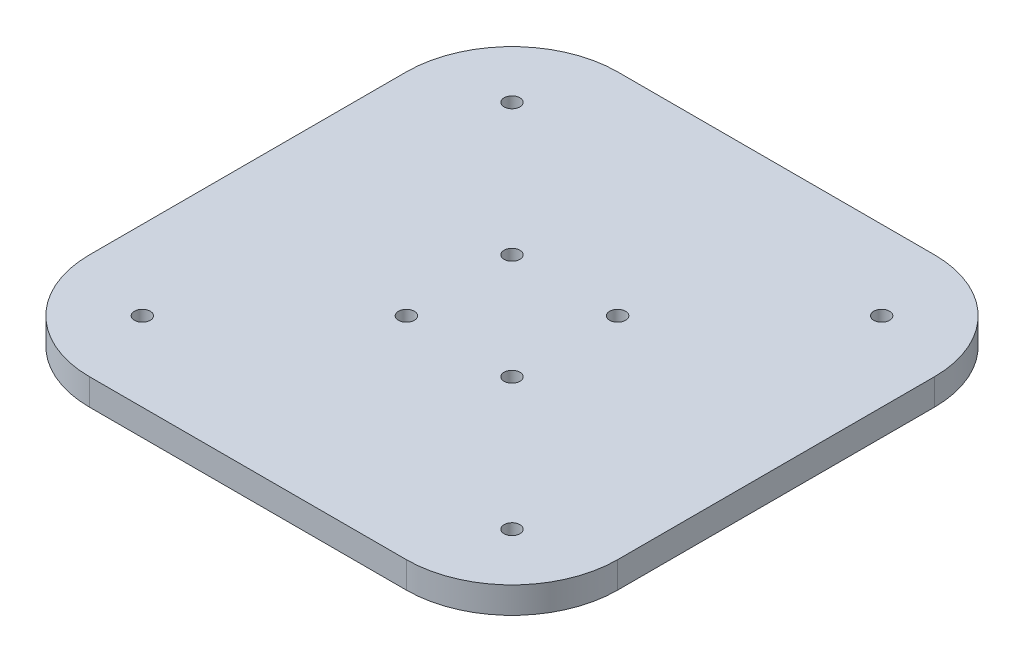
ISO-10303-21;
HEADER;
FILE_DESCRIPTION(('STEP AP214'),'2;1');
FILE_NAME('part.step','',(''),(''),'','','');
FILE_SCHEMA(('AUTOMOTIVE_DESIGN { 1 0 10303 214 1 1 1 1 }'));
ENDSEC;
DATA;
#1=APPLICATION_CONTEXT('core data for automotive mechanical design processes');
#2=APPLICATION_PROTOCOL_DEFINITION('international standard','automotive_design',2000,#1);
#3=PRODUCT_CONTEXT('',#1,'mechanical');
#4=PRODUCT('Part','Part','',(#3));
#5=PRODUCT_RELATED_PRODUCT_CATEGORY('part','',(#4));
#6=PRODUCT_DEFINITION_FORMATION('','',#4);
#7=PRODUCT_DEFINITION_CONTEXT('part definition',#1,'design');
#8=PRODUCT_DEFINITION('design','',#6,#7);
#9=PRODUCT_DEFINITION_SHAPE('','',#8);
#10=(LENGTH_UNIT() NAMED_UNIT(*) SI_UNIT(.MILLI.,.METRE.));
#11=(NAMED_UNIT(*) PLANE_ANGLE_UNIT() SI_UNIT($,.RADIAN.));
#12=(NAMED_UNIT(*) SI_UNIT($,.STERADIAN.) SOLID_ANGLE_UNIT());
#13=UNCERTAINTY_MEASURE_WITH_UNIT(LENGTH_MEASURE(1.E-05),#10,'distance_accuracy_value','');
#14=(GEOMETRIC_REPRESENTATION_CONTEXT(3) GLOBAL_UNCERTAINTY_ASSIGNED_CONTEXT((#13)) GLOBAL_UNIT_ASSIGNED_CONTEXT((#10,
#11,#12)) REPRESENTATION_CONTEXT('',''));
#15=CARTESIAN_POINT('',(0.,0.,0.));
#16=DIRECTION('',(0.,0.,1.));
#17=DIRECTION('',(1.,0.,0.));
#18=AXIS2_PLACEMENT_3D('',#15,#16,#17);
#19=CARTESIAN_POINT('',(0.,5.,0.));
#20=DIRECTION('',(0.,1.,0.));
#21=DIRECTION('',(0.,0.,1.));
#22=AXIS2_PLACEMENT_3D('',#19,#20,#21);
#23=PLANE('',#22);
#24=CARTESIAN_POINT('',(35.000000000005,5.,34.9999999999964));
#25=DIRECTION('',(0.,1.,0.));
#26=DIRECTION('',(0.,0.,1.));
#27=AXIS2_PLACEMENT_3D('',#24,#25,#26);
#28=CIRCLE('',#27,1.50000000000613);
#29=CARTESIAN_POINT('',(35.000000000005,5.,36.5000000000025));
#30=VERTEX_POINT('',#29);
#31=EDGE_CURVE('E216',#30,#30,#28,.T.);
#32=ORIENTED_EDGE('',*,*,#31,.F.);
#33=EDGE_LOOP('',(#32));
#34=FACE_BOUND('',#33,.T.);
#35=CARTESIAN_POINT('',(-10.,5.,10.));
#36=DIRECTION('',(0.,1.,0.));
#37=DIRECTION('',(0.,0.,-1.));
#38=AXIS2_PLACEMENT_3D('',#35,#36,#37);
#39=CIRCLE('',#38,1.5);
#40=CARTESIAN_POINT('',(-10.,5.,8.5));
#41=VERTEX_POINT('',#40);
#42=EDGE_CURVE('E204',#41,#41,#39,.T.);
#43=ORIENTED_EDGE('',*,*,#42,.F.);
#44=EDGE_LOOP('',(#43));
#45=FACE_BOUND('',#44,.T.);
#46=CARTESIAN_POINT('',(10.,5.,-10.));
#47=DIRECTION('',(0.,1.,0.));
#48=DIRECTION('',(0.,0.,-1.));
#49=AXIS2_PLACEMENT_3D('',#46,#47,#48);
#50=CIRCLE('',#49,1.5);
#51=CARTESIAN_POINT('',(10.,5.,-11.5));
#52=VERTEX_POINT('',#51);
#53=EDGE_CURVE('E192',#52,#52,#50,.T.);
#54=ORIENTED_EDGE('',*,*,#53,.F.);
#55=EDGE_LOOP('',(#54));
#56=FACE_BOUND('',#55,.T.);
#57=CARTESIAN_POINT('',(-35.,5.,-35.));
#58=DIRECTION('',(0.,1.,0.));
#59=DIRECTION('',(0.,0.,1.));
#60=AXIS2_PLACEMENT_3D('',#57,#58,#59);
#61=CIRCLE('',#60,1.5);
#62=CARTESIAN_POINT('',(-35.,5.,-33.5));
#63=VERTEX_POINT('',#62);
#64=EDGE_CURVE('E138',#63,#63,#61,.T.);
#65=ORIENTED_EDGE('',*,*,#64,.F.);
#66=EDGE_LOOP('',(#65));
#67=FACE_BOUND('',#66,.T.);
#68=DIRECTION('',(0.,0.,1.));
#69=VECTOR('',#68,1.);
#70=CARTESIAN_POINT('',(-50.,5.,50.));
#71=LINE('',#70,#69);
#72=CARTESIAN_POINT('',(-50.,5.,-30.));
#73=VERTEX_POINT('',#72);
#74=CARTESIAN_POINT('',(-50.,5.,30.));
#75=VERTEX_POINT('',#74);
#76=EDGE_CURVE('E143',#73,#75,#71,.T.);
#77=ORIENTED_EDGE('',*,*,#76,.T.);
#78=CARTESIAN_POINT('',(-30.,5.,30.));
#79=DIRECTION('',(0.,1.,0.));
#80=DIRECTION('',(0.,0.,1.));
#81=AXIS2_PLACEMENT_3D('',#78,#79,#80);
#82=CIRCLE('',#81,20.);
#83=CARTESIAN_POINT('',(-30.,5.,50.));
#84=VERTEX_POINT('',#83);
#85=EDGE_CURVE('E158',#75,#84,#82,.T.);
#86=ORIENTED_EDGE('',*,*,#85,.T.);
#87=DIRECTION('',(1.,0.,0.));
#88=VECTOR('',#87,1.);
#89=CARTESIAN_POINT('',(50.,5.,50.));
#90=LINE('',#89,#88);
#91=CARTESIAN_POINT('',(30.,5.,50.));
#92=VERTEX_POINT('',#91);
#93=EDGE_CURVE('E125',#84,#92,#90,.T.);
#94=ORIENTED_EDGE('',*,*,#93,.T.);
#95=CARTESIAN_POINT('',(30.,5.,30.));
#96=DIRECTION('',(0.,1.,0.));
#97=DIRECTION('',(0.,0.,1.));
#98=AXIS2_PLACEMENT_3D('',#95,#96,#97);
#99=CIRCLE('',#98,20.);
#100=CARTESIAN_POINT('',(50.,5.,30.));
#101=VERTEX_POINT('',#100);
#102=EDGE_CURVE('E156',#92,#101,#99,.T.);
#103=ORIENTED_EDGE('',*,*,#102,.T.);
#104=DIRECTION('',(0.,0.,-1.));
#105=VECTOR('',#104,1.);
#106=CARTESIAN_POINT('',(50.,5.,50.));
#107=LINE('',#106,#105);
#108=CARTESIAN_POINT('',(50.,5.,-30.));
#109=VERTEX_POINT('',#108);
#110=EDGE_CURVE('E169',#101,#109,#107,.T.);
#111=ORIENTED_EDGE('',*,*,#110,.T.);
#112=CARTESIAN_POINT('',(30.,5.,-30.));
#113=DIRECTION('',(0.,1.,0.));
#114=DIRECTION('',(0.,0.,1.));
#115=AXIS2_PLACEMENT_3D('',#112,#113,#114);
#116=CIRCLE('',#115,20.);
#117=CARTESIAN_POINT('',(30.,5.,-50.));
#118=VERTEX_POINT('',#117);
#119=EDGE_CURVE('E60',#109,#118,#116,.T.);
#120=ORIENTED_EDGE('',*,*,#119,.T.);
#121=DIRECTION('',(-1.,0.,0.));
#122=VECTOR('',#121,1.);
#123=CARTESIAN_POINT('',(50.,5.,-50.));
#124=LINE('',#123,#122);
#125=CARTESIAN_POINT('',(-30.,5.,-50.));
#126=VERTEX_POINT('',#125);
#127=EDGE_CURVE('E144',#118,#126,#124,.T.);
#128=ORIENTED_EDGE('',*,*,#127,.T.);
#129=CARTESIAN_POINT('',(-30.,5.,-30.));
#130=DIRECTION('',(0.,1.,0.));
#131=DIRECTION('',(0.,0.,1.));
#132=AXIS2_PLACEMENT_3D('',#129,#130,#131);
#133=CIRCLE('',#132,20.);
#134=EDGE_CURVE('E153',#126,#73,#133,.T.);
#135=ORIENTED_EDGE('',*,*,#134,.T.);
#136=EDGE_LOOP('',(#77,#86,#94,#103,#111,#120,#128,#135));
#137=FACE_BOUND('',#136,.T.);
#138=CARTESIAN_POINT('',(-10.,5.,-10.));
#139=DIRECTION('',(0.,1.,0.));
#140=DIRECTION('',(0.,0.,1.));
#141=AXIS2_PLACEMENT_3D('',#138,#139,#140);
#142=CIRCLE('',#141,1.5);
#143=CARTESIAN_POINT('',(-10.,5.,-8.5));
#144=VERTEX_POINT('',#143);
#145=EDGE_CURVE('E186',#144,#144,#142,.T.);
#146=ORIENTED_EDGE('',*,*,#145,.F.);
#147=EDGE_LOOP('',(#146));
#148=FACE_BOUND('',#147,.T.);
#149=CARTESIAN_POINT('',(10.,5.,10.));
#150=DIRECTION('',(0.,1.,0.));
#151=DIRECTION('',(0.,0.,1.));
#152=AXIS2_PLACEMENT_3D('',#149,#150,#151);
#153=CIRCLE('',#152,1.5);
#154=CARTESIAN_POINT('',(10.,5.,11.5));
#155=VERTEX_POINT('',#154);
#156=EDGE_CURVE('E198',#155,#155,#153,.T.);
#157=ORIENTED_EDGE('',*,*,#156,.F.);
#158=EDGE_LOOP('',(#157));
#159=FACE_BOUND('',#158,.T.);
#160=CARTESIAN_POINT('',(35.0000000000007,5.,-35.0000000000043));
#161=DIRECTION('',(0.,1.,0.));
#162=DIRECTION('',(0.,0.,1.));
#163=AXIS2_PLACEMENT_3D('',#160,#161,#162);
#164=CIRCLE('',#163,1.50000000000408);
#165=CARTESIAN_POINT('',(35.0000000000007,5.,-33.5000000000002));
#166=VERTEX_POINT('',#165);
#167=EDGE_CURVE('E210',#166,#166,#164,.T.);
#168=ORIENTED_EDGE('',*,*,#167,.F.);
#169=EDGE_LOOP('',(#168));
#170=FACE_BOUND('',#169,.T.);
#171=CARTESIAN_POINT('',(-34.9999999999957,5.,35.0000000000007));
#172=DIRECTION('',(0.,1.,0.));
#173=DIRECTION('',(0.,0.,1.));
#174=AXIS2_PLACEMENT_3D('',#171,#172,#173);
#175=CIRCLE('',#174,1.50000000000235);
#176=CARTESIAN_POINT('',(-34.9999999999957,5.,36.500000000003));
#177=VERTEX_POINT('',#176);
#178=EDGE_CURVE('E222',#177,#177,#175,.T.);
#179=ORIENTED_EDGE('',*,*,#178,.F.);
#180=EDGE_LOOP('',(#179));
#181=FACE_BOUND('',#180,.T.);
#182=ADVANCED_FACE('F39',(#34,#45,#56,#67,#137,#148,#159,#170,#181),#23,.T.);
#183=CARTESIAN_POINT('',(0.,0.,0.));
#184=DIRECTION('',(0.,1.,0.));
#185=DIRECTION('',(0.,0.,1.));
#186=AXIS2_PLACEMENT_3D('',#183,#184,#185);
#187=PLANE('',#186);
#188=DIRECTION('',(1.,0.,0.));
#189=VECTOR('',#188,1.);
#190=CARTESIAN_POINT('',(50.,0.,50.));
#191=LINE('',#190,#189);
#192=CARTESIAN_POINT('',(-30.,0.,50.));
#193=VERTEX_POINT('',#192);
#194=CARTESIAN_POINT('',(30.,0.,50.));
#195=VERTEX_POINT('',#194);
#196=EDGE_CURVE('E122',#193,#195,#191,.T.);
#197=ORIENTED_EDGE('',*,*,#196,.F.);
#198=CARTESIAN_POINT('',(-30.,0.,30.));
#199=DIRECTION('',(0.,1.,0.));
#200=DIRECTION('',(0.,0.,1.));
#201=AXIS2_PLACEMENT_3D('',#198,#199,#200);
#202=CIRCLE('',#201,20.);
#203=CARTESIAN_POINT('',(-50.,0.,30.));
#204=VERTEX_POINT('',#203);
#205=EDGE_CURVE('E105',#193,#204,#202,.F.);
#206=ORIENTED_EDGE('',*,*,#205,.T.);
#207=DIRECTION('',(0.,0.,1.));
#208=VECTOR('',#207,1.);
#209=CARTESIAN_POINT('',(-50.,0.,50.));
#210=LINE('',#209,#208);
#211=CARTESIAN_POINT('',(-50.,0.,-30.));
#212=VERTEX_POINT('',#211);
#213=EDGE_CURVE('E133',#212,#204,#210,.T.);
#214=ORIENTED_EDGE('',*,*,#213,.F.);
#215=CARTESIAN_POINT('',(-30.,0.,-30.));
#216=DIRECTION('',(0.,1.,0.));
#217=DIRECTION('',(0.,0.,1.));
#218=AXIS2_PLACEMENT_3D('',#215,#216,#217);
#219=CIRCLE('',#218,20.);
#220=CARTESIAN_POINT('',(-30.,0.,-50.));
#221=VERTEX_POINT('',#220);
#222=EDGE_CURVE('E126',#212,#221,#219,.F.);
#223=ORIENTED_EDGE('',*,*,#222,.T.);
#224=DIRECTION('',(-1.,0.,0.));
#225=VECTOR('',#224,1.);
#226=CARTESIAN_POINT('',(50.,0.,-50.));
#227=LINE('',#226,#225);
#228=CARTESIAN_POINT('',(30.,0.,-50.));
#229=VERTEX_POINT('',#228);
#230=EDGE_CURVE('E136',#229,#221,#227,.T.);
#231=ORIENTED_EDGE('',*,*,#230,.F.);
#232=CARTESIAN_POINT('',(30.,0.,-30.));
#233=DIRECTION('',(0.,1.,0.));
#234=DIRECTION('',(0.,0.,1.));
#235=AXIS2_PLACEMENT_3D('',#232,#233,#234);
#236=CIRCLE('',#235,20.);
#237=CARTESIAN_POINT('',(50.,0.,-30.));
#238=VERTEX_POINT('',#237);
#239=EDGE_CURVE('E147',#229,#238,#236,.F.);
#240=ORIENTED_EDGE('',*,*,#239,.T.);
#241=DIRECTION('',(0.,0.,-1.));
#242=VECTOR('',#241,1.);
#243=CARTESIAN_POINT('',(50.,0.,50.));
#244=LINE('',#243,#242);
#245=CARTESIAN_POINT('',(50.,0.,30.));
#246=VERTEX_POINT('',#245);
#247=EDGE_CURVE('E132',#246,#238,#244,.T.);
#248=ORIENTED_EDGE('',*,*,#247,.F.);
#249=CARTESIAN_POINT('',(30.,0.,30.));
#250=DIRECTION('',(0.,1.,0.));
#251=DIRECTION('',(0.,0.,1.));
#252=AXIS2_PLACEMENT_3D('',#249,#250,#251);
#253=CIRCLE('',#252,20.);
#254=EDGE_CURVE('E116',#246,#195,#253,.F.);
#255=ORIENTED_EDGE('',*,*,#254,.T.);
#256=EDGE_LOOP('',(#197,#206,#214,#223,#231,#240,#248,#255));
#257=FACE_BOUND('',#256,.T.);
#258=CARTESIAN_POINT('',(-35.,0.,-35.));
#259=DIRECTION('',(0.,1.,0.));
#260=DIRECTION('',(0.,0.,1.));
#261=AXIS2_PLACEMENT_3D('',#258,#259,#260);
#262=CIRCLE('',#261,1.5);
#263=CARTESIAN_POINT('',(-35.,0.,-33.5));
#264=VERTEX_POINT('',#263);
#265=EDGE_CURVE('E183',#264,#264,#262,.T.);
#266=ORIENTED_EDGE('',*,*,#265,.T.);
#267=EDGE_LOOP('',(#266));
#268=FACE_BOUND('',#267,.T.);
#269=CARTESIAN_POINT('',(-10.,0.,-10.));
#270=DIRECTION('',(0.,1.,0.));
#271=DIRECTION('',(0.,0.,1.));
#272=AXIS2_PLACEMENT_3D('',#269,#270,#271);
#273=CIRCLE('',#272,1.5);
#274=CARTESIAN_POINT('',(-10.,0.,-8.5));
#275=VERTEX_POINT('',#274);
#276=EDGE_CURVE('E189',#275,#275,#273,.T.);
#277=ORIENTED_EDGE('',*,*,#276,.T.);
#278=EDGE_LOOP('',(#277));
#279=FACE_BOUND('',#278,.T.);
#280=CARTESIAN_POINT('',(10.,0.,-10.));
#281=DIRECTION('',(0.,1.,0.));
#282=DIRECTION('',(0.,0.,-1.));
#283=AXIS2_PLACEMENT_3D('',#280,#281,#282);
#284=CIRCLE('',#283,1.5);
#285=CARTESIAN_POINT('',(10.,0.,-11.5));
#286=VERTEX_POINT('',#285);
#287=EDGE_CURVE('E195',#286,#286,#284,.T.);
#288=ORIENTED_EDGE('',*,*,#287,.T.);
#289=EDGE_LOOP('',(#288));
#290=FACE_BOUND('',#289,.T.);
#291=CARTESIAN_POINT('',(10.,0.,10.));
#292=DIRECTION('',(0.,1.,0.));
#293=DIRECTION('',(0.,0.,1.));
#294=AXIS2_PLACEMENT_3D('',#291,#292,#293);
#295=CIRCLE('',#294,1.5);
#296=CARTESIAN_POINT('',(10.,0.,11.5));
#297=VERTEX_POINT('',#296);
#298=EDGE_CURVE('E201',#297,#297,#295,.T.);
#299=ORIENTED_EDGE('',*,*,#298,.T.);
#300=EDGE_LOOP('',(#299));
#301=FACE_BOUND('',#300,.T.);
#302=CARTESIAN_POINT('',(-10.,0.,10.));
#303=DIRECTION('',(0.,1.,0.));
#304=DIRECTION('',(0.,0.,-1.));
#305=AXIS2_PLACEMENT_3D('',#302,#303,#304);
#306=CIRCLE('',#305,1.5);
#307=CARTESIAN_POINT('',(-10.,0.,8.5));
#308=VERTEX_POINT('',#307);
#309=EDGE_CURVE('E207',#308,#308,#306,.T.);
#310=ORIENTED_EDGE('',*,*,#309,.T.);
#311=EDGE_LOOP('',(#310));
#312=FACE_BOUND('',#311,.T.);
#313=CARTESIAN_POINT('',(35.0000000000007,0.,-35.0000000000043));
#314=DIRECTION('',(0.,1.,0.));
#315=DIRECTION('',(0.,0.,1.));
#316=AXIS2_PLACEMENT_3D('',#313,#314,#315);
#317=CIRCLE('',#316,1.50000000000408);
#318=CARTESIAN_POINT('',(35.0000000000007,0.,-33.5000000000002));
#319=VERTEX_POINT('',#318);
#320=EDGE_CURVE('E213',#319,#319,#317,.T.);
#321=ORIENTED_EDGE('',*,*,#320,.T.);
#322=EDGE_LOOP('',(#321));
#323=FACE_BOUND('',#322,.T.);
#324=CARTESIAN_POINT('',(35.000000000005,0.,34.9999999999964));
#325=DIRECTION('',(0.,1.,0.));
#326=DIRECTION('',(0.,0.,1.));
#327=AXIS2_PLACEMENT_3D('',#324,#325,#326);
#328=CIRCLE('',#327,1.50000000000613);
#329=CARTESIAN_POINT('',(35.000000000005,0.,36.5000000000025));
#330=VERTEX_POINT('',#329);
#331=EDGE_CURVE('E219',#330,#330,#328,.T.);
#332=ORIENTED_EDGE('',*,*,#331,.T.);
#333=EDGE_LOOP('',(#332));
#334=FACE_BOUND('',#333,.T.);
#335=CARTESIAN_POINT('',(-34.9999999999957,0.,35.0000000000007));
#336=DIRECTION('',(0.,1.,0.));
#337=DIRECTION('',(0.,0.,1.));
#338=AXIS2_PLACEMENT_3D('',#335,#336,#337);
#339=CIRCLE('',#338,1.50000000000235);
#340=CARTESIAN_POINT('',(-34.9999999999957,0.,36.500000000003));
#341=VERTEX_POINT('',#340);
#342=EDGE_CURVE('E225',#341,#341,#339,.T.);
#343=ORIENTED_EDGE('',*,*,#342,.T.);
#344=EDGE_LOOP('',(#343));
#345=FACE_BOUND('',#344,.T.);
#346=ADVANCED_FACE('F129',(#257,#268,#279,#290,#301,#312,#323,#334,#345),#187,.F.);
#347=CARTESIAN_POINT('',(-50.,5.,50.));
#348=DIRECTION('',(1.,0.,0.));
#349=DIRECTION('',(0.,0.,-1.));
#350=AXIS2_PLACEMENT_3D('',#347,#348,#349);
#351=PLANE('',#350);
#352=ORIENTED_EDGE('',*,*,#213,.T.);
#353=DIRECTION('',(0.,-1.,0.));
#354=VECTOR('',#353,1.);
#355=CARTESIAN_POINT('',(-50.,5.,30.));
#356=LINE('',#355,#354);
#357=EDGE_CURVE('E110',#204,#75,#356,.F.);
#358=ORIENTED_EDGE('',*,*,#357,.T.);
#359=ORIENTED_EDGE('',*,*,#76,.F.);
#360=DIRECTION('',(0.,-1.,0.));
#361=VECTOR('',#360,1.);
#362=CARTESIAN_POINT('',(-50.,5.,-30.));
#363=LINE('',#362,#361);
#364=EDGE_CURVE('E115',#73,#212,#363,.T.);
#365=ORIENTED_EDGE('',*,*,#364,.T.);
#366=EDGE_LOOP('',(#352,#358,#359,#365));
#367=FACE_BOUND('',#366,.T.);
#368=ADVANCED_FACE('F241',(#367),#351,.F.);
#369=CARTESIAN_POINT('',(50.,5.,50.));
#370=DIRECTION('',(0.,0.,-1.));
#371=DIRECTION('',(-1.,0.,0.));
#372=AXIS2_PLACEMENT_3D('',#369,#370,#371);
#373=PLANE('',#372);
#374=ORIENTED_EDGE('',*,*,#93,.F.);
#375=DIRECTION('',(0.,-1.,0.));
#376=VECTOR('',#375,1.);
#377=CARTESIAN_POINT('',(-30.,5.,50.));
#378=LINE('',#377,#376);
#379=EDGE_CURVE('E109',#84,#193,#378,.T.);
#380=ORIENTED_EDGE('',*,*,#379,.T.);
#381=ORIENTED_EDGE('',*,*,#196,.T.);
#382=DIRECTION('',(0.,-1.,0.));
#383=VECTOR('',#382,1.);
#384=CARTESIAN_POINT('',(30.,5.,50.));
#385=LINE('',#384,#383);
#386=EDGE_CURVE('E127',#195,#92,#385,.F.);
#387=ORIENTED_EDGE('',*,*,#386,.T.);
#388=EDGE_LOOP('',(#374,#380,#381,#387));
#389=FACE_BOUND('',#388,.T.);
#390=ADVANCED_FACE('F121',(#389),#373,.F.);
#391=CARTESIAN_POINT('',(50.,5.,50.));
#392=DIRECTION('',(-1.,0.,0.));
#393=DIRECTION('',(0.,0.,1.));
#394=AXIS2_PLACEMENT_3D('',#391,#392,#393);
#395=PLANE('',#394);
#396=ORIENTED_EDGE('',*,*,#110,.F.);
#397=DIRECTION('',(0.,-1.,0.));
#398=VECTOR('',#397,1.);
#399=CARTESIAN_POINT('',(50.,5.,30.));
#400=LINE('',#399,#398);
#401=EDGE_CURVE('E162',#101,#246,#400,.T.);
#402=ORIENTED_EDGE('',*,*,#401,.T.);
#403=ORIENTED_EDGE('',*,*,#247,.T.);
#404=DIRECTION('',(0.,-1.,0.));
#405=VECTOR('',#404,1.);
#406=CARTESIAN_POINT('',(50.,5.,-30.));
#407=LINE('',#406,#405);
#408=EDGE_CURVE('E160',#238,#109,#407,.F.);
#409=ORIENTED_EDGE('',*,*,#408,.T.);
#410=EDGE_LOOP('',(#396,#402,#403,#409));
#411=FACE_BOUND('',#410,.T.);
#412=ADVANCED_FACE('F167',(#411),#395,.F.);
#413=CARTESIAN_POINT('',(50.,5.,-50.));
#414=DIRECTION('',(0.,0.,1.));
#415=DIRECTION('',(1.,0.,0.));
#416=AXIS2_PLACEMENT_3D('',#413,#414,#415);
#417=PLANE('',#416);
#418=ORIENTED_EDGE('',*,*,#127,.F.);
#419=DIRECTION('',(0.,-1.,0.));
#420=VECTOR('',#419,1.);
#421=CARTESIAN_POINT('',(30.,5.,-50.));
#422=LINE('',#421,#420);
#423=EDGE_CURVE('E11',#118,#229,#422,.T.);
#424=ORIENTED_EDGE('',*,*,#423,.T.);
#425=ORIENTED_EDGE('',*,*,#230,.T.);
#426=DIRECTION('',(0.,-1.,0.));
#427=VECTOR('',#426,1.);
#428=CARTESIAN_POINT('',(-30.,5.,-50.));
#429=LINE('',#428,#427);
#430=EDGE_CURVE('E47',#221,#126,#429,.F.);
#431=ORIENTED_EDGE('',*,*,#430,.T.);
#432=EDGE_LOOP('',(#418,#424,#425,#431));
#433=FACE_BOUND('',#432,.T.);
#434=ADVANCED_FACE('F176',(#433),#417,.F.);
#435=CARTESIAN_POINT('',(-35.,5.,-35.));
#436=DIRECTION('',(0.,-1.,0.));
#437=DIRECTION('',(0.,0.,-1.));
#438=AXIS2_PLACEMENT_3D('',#435,#436,#437);
#439=CYLINDRICAL_SURFACE('',#438,1.5);
#440=ORIENTED_EDGE('',*,*,#64,.T.);
#441=EDGE_LOOP('',(#440));
#442=FACE_BOUND('',#441,.T.);
#443=ORIENTED_EDGE('',*,*,#265,.F.);
#444=EDGE_LOOP('',(#443));
#445=FACE_BOUND('',#444,.T.);
#446=ADVANCED_FACE('F246',(#442,#445),#439,.F.);
#447=CARTESIAN_POINT('',(-10.,5.,-10.));
#448=DIRECTION('',(0.,-1.,0.));
#449=DIRECTION('',(0.,0.,-1.));
#450=AXIS2_PLACEMENT_3D('',#447,#448,#449);
#451=CYLINDRICAL_SURFACE('',#450,1.5);
#452=ORIENTED_EDGE('',*,*,#145,.T.);
#453=EDGE_LOOP('',(#452));
#454=FACE_BOUND('',#453,.T.);
#455=ORIENTED_EDGE('',*,*,#276,.F.);
#456=EDGE_LOOP('',(#455));
#457=FACE_BOUND('',#456,.T.);
#458=ADVANCED_FACE('F306',(#454,#457),#451,.F.);
#459=CARTESIAN_POINT('',(10.,5.,-10.));
#460=DIRECTION('',(0.,-1.,0.));
#461=DIRECTION('',(0.,0.,-1.));
#462=AXIS2_PLACEMENT_3D('',#459,#460,#461);
#463=CYLINDRICAL_SURFACE('',#462,1.5);
#464=ORIENTED_EDGE('',*,*,#53,.T.);
#465=EDGE_LOOP('',(#464));
#466=FACE_BOUND('',#465,.T.);
#467=ORIENTED_EDGE('',*,*,#287,.F.);
#468=EDGE_LOOP('',(#467));
#469=FACE_BOUND('',#468,.T.);
#470=ADVANCED_FACE('F303',(#466,#469),#463,.F.);
#471=CARTESIAN_POINT('',(10.,5.,10.));
#472=DIRECTION('',(0.,-1.,0.));
#473=DIRECTION('',(0.,0.,-1.));
#474=AXIS2_PLACEMENT_3D('',#471,#472,#473);
#475=CYLINDRICAL_SURFACE('',#474,1.5);
#476=ORIENTED_EDGE('',*,*,#156,.T.);
#477=EDGE_LOOP('',(#476));
#478=FACE_BOUND('',#477,.T.);
#479=ORIENTED_EDGE('',*,*,#298,.F.);
#480=EDGE_LOOP('',(#479));
#481=FACE_BOUND('',#480,.T.);
#482=ADVANCED_FACE('F299',(#478,#481),#475,.F.);
#483=CARTESIAN_POINT('',(-10.,5.,10.));
#484=DIRECTION('',(0.,-1.,0.));
#485=DIRECTION('',(0.,0.,-1.));
#486=AXIS2_PLACEMENT_3D('',#483,#484,#485);
#487=CYLINDRICAL_SURFACE('',#486,1.5);
#488=ORIENTED_EDGE('',*,*,#42,.T.);
#489=EDGE_LOOP('',(#488));
#490=FACE_BOUND('',#489,.T.);
#491=ORIENTED_EDGE('',*,*,#309,.F.);
#492=EDGE_LOOP('',(#491));
#493=FACE_BOUND('',#492,.T.);
#494=ADVANCED_FACE('F282',(#490,#493),#487,.F.);
#495=CARTESIAN_POINT('',(35.0000000000007,5.,-35.0000000000043));
#496=DIRECTION('',(0.,-1.,0.));
#497=DIRECTION('',(0.,0.,-1.));
#498=AXIS2_PLACEMENT_3D('',#495,#496,#497);
#499=CYLINDRICAL_SURFACE('',#498,1.50000000000408);
#500=ORIENTED_EDGE('',*,*,#167,.T.);
#501=EDGE_LOOP('',(#500));
#502=FACE_BOUND('',#501,.T.);
#503=ORIENTED_EDGE('',*,*,#320,.F.);
#504=EDGE_LOOP('',(#503));
#505=FACE_BOUND('',#504,.T.);
#506=ADVANCED_FACE('F278',(#502,#505),#499,.F.);
#507=CARTESIAN_POINT('',(35.000000000005,5.,34.9999999999964));
#508=DIRECTION('',(0.,-1.,0.));
#509=DIRECTION('',(0.,0.,-1.));
#510=AXIS2_PLACEMENT_3D('',#507,#508,#509);
#511=CYLINDRICAL_SURFACE('',#510,1.50000000000613);
#512=ORIENTED_EDGE('',*,*,#31,.T.);
#513=EDGE_LOOP('',(#512));
#514=FACE_BOUND('',#513,.T.);
#515=ORIENTED_EDGE('',*,*,#331,.F.);
#516=EDGE_LOOP('',(#515));
#517=FACE_BOUND('',#516,.T.);
#518=ADVANCED_FACE('F281',(#514,#517),#511,.F.);
#519=CARTESIAN_POINT('',(-34.9999999999957,5.,35.0000000000007));
#520=DIRECTION('',(0.,-1.,0.));
#521=DIRECTION('',(0.,0.,-1.));
#522=AXIS2_PLACEMENT_3D('',#519,#520,#521);
#523=CYLINDRICAL_SURFACE('',#522,1.50000000000235);
#524=ORIENTED_EDGE('',*,*,#178,.T.);
#525=EDGE_LOOP('',(#524));
#526=FACE_BOUND('',#525,.T.);
#527=ORIENTED_EDGE('',*,*,#342,.F.);
#528=EDGE_LOOP('',(#527));
#529=FACE_BOUND('',#528,.T.);
#530=ADVANCED_FACE('F231',(#526,#529),#523,.F.);
#531=CARTESIAN_POINT('',(-30.,5.,30.));
#532=DIRECTION('',(0.,-1.,0.));
#533=DIRECTION('',(0.,0.,-1.));
#534=AXIS2_PLACEMENT_3D('',#531,#532,#533);
#535=CYLINDRICAL_SURFACE('',#534,20.);
#536=ORIENTED_EDGE('',*,*,#85,.F.);
#537=ORIENTED_EDGE('',*,*,#357,.F.);
#538=ORIENTED_EDGE('',*,*,#205,.F.);
#539=ORIENTED_EDGE('',*,*,#379,.F.);
#540=EDGE_LOOP('',(#536,#537,#538,#539));
#541=FACE_BOUND('',#540,.T.);
#542=ADVANCED_FACE('F108',(#541),#535,.T.);
#543=CARTESIAN_POINT('',(30.,5.,30.));
#544=DIRECTION('',(0.,-1.,0.));
#545=DIRECTION('',(0.,0.,-1.));
#546=AXIS2_PLACEMENT_3D('',#543,#544,#545);
#547=CYLINDRICAL_SURFACE('',#546,20.);
#548=ORIENTED_EDGE('',*,*,#102,.F.);
#549=ORIENTED_EDGE('',*,*,#386,.F.);
#550=ORIENTED_EDGE('',*,*,#254,.F.);
#551=ORIENTED_EDGE('',*,*,#401,.F.);
#552=EDGE_LOOP('',(#548,#549,#550,#551));
#553=FACE_BOUND('',#552,.T.);
#554=ADVANCED_FACE('F260',(#553),#547,.T.);
#555=CARTESIAN_POINT('',(30.,5.,-30.));
#556=DIRECTION('',(0.,-1.,0.));
#557=DIRECTION('',(0.,0.,-1.));
#558=AXIS2_PLACEMENT_3D('',#555,#556,#557);
#559=CYLINDRICAL_SURFACE('',#558,20.);
#560=ORIENTED_EDGE('',*,*,#119,.F.);
#561=ORIENTED_EDGE('',*,*,#408,.F.);
#562=ORIENTED_EDGE('',*,*,#239,.F.);
#563=ORIENTED_EDGE('',*,*,#423,.F.);
#564=EDGE_LOOP('',(#560,#561,#562,#563));
#565=FACE_BOUND('',#564,.T.);
#566=ADVANCED_FACE('F175',(#565),#559,.T.);
#567=CARTESIAN_POINT('',(-30.,5.,-30.));
#568=DIRECTION('',(0.,-1.,0.));
#569=DIRECTION('',(0.,0.,-1.));
#570=AXIS2_PLACEMENT_3D('',#567,#568,#569);
#571=CYLINDRICAL_SURFACE('',#570,20.);
#572=ORIENTED_EDGE('',*,*,#134,.F.);
#573=ORIENTED_EDGE('',*,*,#430,.F.);
#574=ORIENTED_EDGE('',*,*,#222,.F.);
#575=ORIENTED_EDGE('',*,*,#364,.F.);
#576=EDGE_LOOP('',(#572,#573,#574,#575));
#577=FACE_BOUND('',#576,.T.);
#578=ADVANCED_FACE('F41',(#577),#571,.T.);
#579=CLOSED_SHELL('',(#182,#346,#368,#390,#412,#434,#446,#458,#470,#482,#494,#506,#518,#530,
#542,#554,#566,#578));
#580=MANIFOLD_SOLID_BREP('B2',#579);
#581=ADVANCED_BREP_SHAPE_REPRESENTATION('',(#18,#580),#14);
#582=SHAPE_DEFINITION_REPRESENTATION(#9,#581);
ENDSEC;
END-ISO-10303-21;
